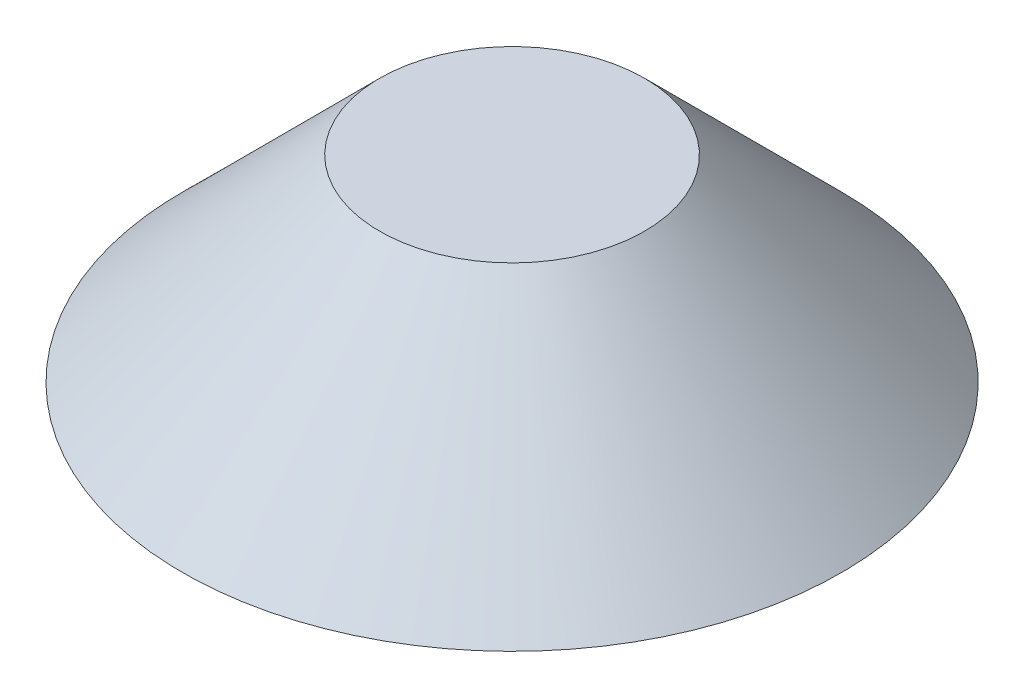
ISO-10303-21;
HEADER;
FILE_DESCRIPTION(('STEP AP214'),'2;1');
FILE_NAME('part.step','',(''),(''),'','','');
FILE_SCHEMA(('AUTOMOTIVE_DESIGN { 1 0 10303 214 1 1 1 1 }'));
ENDSEC;
DATA;
#1=APPLICATION_CONTEXT('core data for automotive mechanical design processes');
#2=APPLICATION_PROTOCOL_DEFINITION('international standard','automotive_design',2000,#1);
#3=PRODUCT_CONTEXT('',#1,'mechanical');
#4=PRODUCT('Part','Part','',(#3));
#5=PRODUCT_RELATED_PRODUCT_CATEGORY('part','',(#4));
#6=PRODUCT_DEFINITION_FORMATION('','',#4);
#7=PRODUCT_DEFINITION_CONTEXT('part definition',#1,'design');
#8=PRODUCT_DEFINITION('design','',#6,#7);
#9=PRODUCT_DEFINITION_SHAPE('','',#8);
#10=(LENGTH_UNIT() NAMED_UNIT(*) SI_UNIT(.MILLI.,.METRE.));
#11=(NAMED_UNIT(*) PLANE_ANGLE_UNIT() SI_UNIT($,.RADIAN.));
#12=(NAMED_UNIT(*) SI_UNIT($,.STERADIAN.) SOLID_ANGLE_UNIT());
#13=UNCERTAINTY_MEASURE_WITH_UNIT(LENGTH_MEASURE(1.E-05),#10,'distance_accuracy_value','');
#14=(GEOMETRIC_REPRESENTATION_CONTEXT(3) GLOBAL_UNCERTAINTY_ASSIGNED_CONTEXT((#13)) GLOBAL_UNIT_ASSIGNED_CONTEXT((#10,
#11,#12)) REPRESENTATION_CONTEXT('',''));
#15=CARTESIAN_POINT('',(0.,0.,0.));
#16=DIRECTION('',(0.,0.,1.));
#17=DIRECTION('',(1.,0.,0.));
#18=AXIS2_PLACEMENT_3D('',#15,#16,#17);
#19=CARTESIAN_POINT('',(0.,7.47405263949122,0.));
#20=DIRECTION('',(0.,-1.,0.));
#21=DIRECTION('',(0.,0.,-1.));
#22=AXIS2_PLACEMENT_3D('',#19,#20,#21);
#23=PLANE('',#22);
#24=CARTESIAN_POINT('',(0.,7.47405263949122,0.));
#25=DIRECTION('',(0.,-1.,0.));
#26=DIRECTION('',(0.,0.,-1.));
#27=AXIS2_PLACEMENT_3D('',#24,#25,#26);
#28=CIRCLE('',#27,5.02594736050877);
#29=CARTESIAN_POINT('',(0.,7.47405263949122,-5.02594736050877));
#30=VERTEX_POINT('',#29);
#31=EDGE_CURVE('E10',#30,#30,#28,.T.);
#32=ORIENTED_EDGE('',*,*,#31,.F.);
#33=EDGE_LOOP('',(#32));
#34=FACE_BOUND('',#33,.T.);
#35=ADVANCED_FACE('F31',(#34),#23,.F.);
#36=CARTESIAN_POINT('',(0.,7.47405263949122,0.));
#37=DIRECTION('',(0.,-1.,0.));
#38=DIRECTION('',(0.,0.,-1.));
#39=AXIS2_PLACEMENT_3D('',#36,#37,#38);
#40=CONICAL_SURFACE('',#39,5.02594736050877,0.785398163397448);
#41=CARTESIAN_POINT('',(0.,0.,0.));
#42=DIRECTION('',(0.,-1.,0.));
#43=DIRECTION('',(0.,0.,-1.));
#44=AXIS2_PLACEMENT_3D('',#41,#42,#43);
#45=CIRCLE('',#44,12.5);
#46=CARTESIAN_POINT('',(0.,0.,-12.5));
#47=VERTEX_POINT('',#46);
#48=EDGE_CURVE('E37',#47,#47,#45,.T.);
#49=ORIENTED_EDGE('',*,*,#48,.F.);
#50=EDGE_LOOP('',(#49));
#51=FACE_BOUND('',#50,.T.);
#52=ORIENTED_EDGE('',*,*,#31,.T.);
#53=EDGE_LOOP('',(#52));
#54=FACE_BOUND('',#53,.T.);
#55=ADVANCED_FACE('F45',(#51,#54),#40,.T.);
#56=CARTESIAN_POINT('',(0.,0.,0.));
#57=DIRECTION('',(0.,1.,0.));
#58=DIRECTION('',(0.,0.,1.));
#59=AXIS2_PLACEMENT_3D('',#56,#57,#58);
#60=PLANE('',#59);
#61=ORIENTED_EDGE('',*,*,#48,.T.);
#62=EDGE_LOOP('',(#61));
#63=FACE_BOUND('',#62,.T.);
#64=ADVANCED_FACE('F43',(#63),#60,.F.);
#65=CLOSED_SHELL('',(#35,#55,#64));
#66=MANIFOLD_SOLID_BREP('B2',#65);
#67=ADVANCED_BREP_SHAPE_REPRESENTATION('',(#18,#66),#14);
#68=SHAPE_DEFINITION_REPRESENTATION(#9,#67);
ENDSEC;
END-ISO-10303-21;
